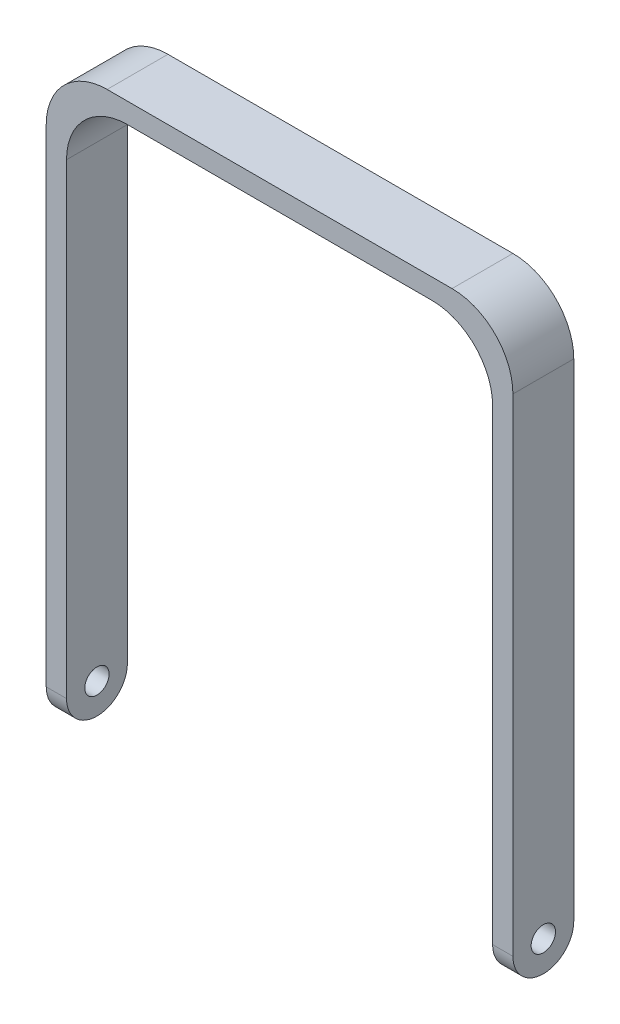
ISO-10303-21;
HEADER;
FILE_DESCRIPTION(('STEP AP214'),'2;1');
FILE_NAME('part.step','',(''),(''),'','','');
FILE_SCHEMA(('AUTOMOTIVE_DESIGN { 1 0 10303 214 1 1 1 1 }'));
ENDSEC;
DATA;
#1=APPLICATION_CONTEXT('core data for automotive mechanical design processes');
#2=APPLICATION_PROTOCOL_DEFINITION('international standard','automotive_design',2000,#1);
#3=PRODUCT_CONTEXT('',#1,'mechanical');
#4=PRODUCT('Part','Part','',(#3));
#5=PRODUCT_RELATED_PRODUCT_CATEGORY('part','',(#4));
#6=PRODUCT_DEFINITION_FORMATION('','',#4);
#7=PRODUCT_DEFINITION_CONTEXT('part definition',#1,'design');
#8=PRODUCT_DEFINITION('design','',#6,#7);
#9=PRODUCT_DEFINITION_SHAPE('','',#8);
#10=(LENGTH_UNIT() NAMED_UNIT(*) SI_UNIT(.MILLI.,.METRE.));
#11=(NAMED_UNIT(*) PLANE_ANGLE_UNIT() SI_UNIT($,.RADIAN.));
#12=(NAMED_UNIT(*) SI_UNIT($,.STERADIAN.) SOLID_ANGLE_UNIT());
#13=UNCERTAINTY_MEASURE_WITH_UNIT(LENGTH_MEASURE(1.E-05),#10,'distance_accuracy_value','');
#14=(GEOMETRIC_REPRESENTATION_CONTEXT(3) GLOBAL_UNCERTAINTY_ASSIGNED_CONTEXT((#13)) GLOBAL_UNIT_ASSIGNED_CONTEXT((#10,
#11,#12)) REPRESENTATION_CONTEXT('',''));
#15=CARTESIAN_POINT('',(0.,0.,0.));
#16=DIRECTION('',(0.,0.,1.));
#17=DIRECTION('',(1.,0.,0.));
#18=AXIS2_PLACEMENT_3D('',#15,#16,#17);
#19=CARTESIAN_POINT('',(36.5125,-46.0375,4.7625));
#20=DIRECTION('',(-1.,0.,0.));
#21=DIRECTION('',(0.,0.,1.));
#22=AXIS2_PLACEMENT_3D('',#19,#20,#21);
#23=PLANE('',#22);
#24=CARTESIAN_POINT('',(36.5125,-39.6875,0.));
#25=DIRECTION('',(-1.,0.,0.));
#26=DIRECTION('',(0.,0.,1.));
#27=AXIS2_PLACEMENT_3D('',#24,#25,#26);
#28=CIRCLE('',#27,1.905);
#29=CARTESIAN_POINT('',(36.5125,-39.6875,1.90500000000001));
#30=VERTEX_POINT('',#29);
#31=EDGE_CURVE('E229',#30,#30,#28,.T.);
#32=ORIENTED_EDGE('',*,*,#31,.T.);
#33=EDGE_LOOP('',(#32));
#34=FACE_BOUND('',#33,.T.);
#35=DIRECTION('',(0.,1.,0.));
#36=VECTOR('',#35,1.);
#37=CARTESIAN_POINT('',(36.5125,-46.0375,-4.7625));
#38=LINE('',#37,#36);
#39=CARTESIAN_POINT('',(36.5125,-39.6875,-4.7625));
#40=VERTEX_POINT('',#39);
#41=CARTESIAN_POINT('',(36.5125,36.5125,-4.7625));
#42=VERTEX_POINT('',#41);
#43=EDGE_CURVE('E136',#40,#42,#38,.T.);
#44=ORIENTED_EDGE('',*,*,#43,.T.);
#45=DIRECTION('',(0.,0.,-1.));
#46=VECTOR('',#45,1.);
#47=CARTESIAN_POINT('',(36.5125,36.5125,4.7625));
#48=LINE('',#47,#46);
#49=CARTESIAN_POINT('',(36.5125,36.5125,4.7625));
#50=VERTEX_POINT('',#49);
#51=EDGE_CURVE('E48',#42,#50,#48,.F.);
#52=ORIENTED_EDGE('',*,*,#51,.T.);
#53=DIRECTION('',(0.,1.,0.));
#54=VECTOR('',#53,1.);
#55=CARTESIAN_POINT('',(36.5125,-46.0375,4.7625));
#56=LINE('',#55,#54);
#57=CARTESIAN_POINT('',(36.5125,-39.6875,4.76250000000002));
#58=VERTEX_POINT('',#57);
#59=EDGE_CURVE('E137',#58,#50,#56,.T.);
#60=ORIENTED_EDGE('',*,*,#59,.F.);
#61=CARTESIAN_POINT('',(36.5125,-39.6875,0.));
#62=DIRECTION('',(1.,0.,0.));
#63=DIRECTION('',(0.,0.,1.));
#64=AXIS2_PLACEMENT_3D('',#61,#62,#63);
#65=CIRCLE('',#64,4.76250000000001);
#66=EDGE_CURVE('E127',#58,#40,#65,.T.);
#67=ORIENTED_EDGE('',*,*,#66,.T.);
#68=EDGE_LOOP('',(#44,#52,#60,#67));
#69=FACE_BOUND('',#68,.T.);
#70=ADVANCED_FACE('F33',(#34,#69),#23,.F.);
#71=CARTESIAN_POINT('',(-36.5125,46.0375,4.7625));
#72=DIRECTION('',(0.,-1.,0.));
#73=DIRECTION('',(0.,0.,-1.));
#74=AXIS2_PLACEMENT_3D('',#71,#72,#73);
#75=PLANE('',#74);
#76=DIRECTION('',(-1.,0.,0.));
#77=VECTOR('',#76,1.);
#78=CARTESIAN_POINT('',(-36.5125,46.0375,-4.7625));
#79=LINE('',#78,#77);
#80=CARTESIAN_POINT('',(26.9875,46.0375,-4.7625));
#81=VERTEX_POINT('',#80);
#82=CARTESIAN_POINT('',(-26.9875,46.0375,-4.7625));
#83=VERTEX_POINT('',#82);
#84=EDGE_CURVE('E143',#81,#83,#79,.T.);
#85=ORIENTED_EDGE('',*,*,#84,.T.);
#86=DIRECTION('',(0.,0.,-1.));
#87=VECTOR('',#86,1.);
#88=CARTESIAN_POINT('',(-26.9875,46.0375,4.7625));
#89=LINE('',#88,#87);
#90=CARTESIAN_POINT('',(-26.9875,46.0375,4.7625));
#91=VERTEX_POINT('',#90);
#92=EDGE_CURVE('E190',#83,#91,#89,.F.);
#93=ORIENTED_EDGE('',*,*,#92,.T.);
#94=DIRECTION('',(-1.,0.,0.));
#95=VECTOR('',#94,1.);
#96=CARTESIAN_POINT('',(-36.5125,46.0375,4.7625));
#97=LINE('',#96,#95);
#98=CARTESIAN_POINT('',(26.9875,46.0375,4.7625));
#99=VERTEX_POINT('',#98);
#100=EDGE_CURVE('E220',#99,#91,#97,.T.);
#101=ORIENTED_EDGE('',*,*,#100,.F.);
#102=DIRECTION('',(0.,0.,-1.));
#103=VECTOR('',#102,1.);
#104=CARTESIAN_POINT('',(26.9875,46.0375,4.7625));
#105=LINE('',#104,#103);
#106=EDGE_CURVE('E187',#99,#81,#105,.T.);
#107=ORIENTED_EDGE('',*,*,#106,.T.);
#108=EDGE_LOOP('',(#85,#93,#101,#107));
#109=FACE_BOUND('',#108,.T.);
#110=ADVANCED_FACE('F245',(#109),#75,.F.);
#111=CARTESIAN_POINT('',(-36.5125,-46.0375,4.7625));
#112=DIRECTION('',(1.,0.,0.));
#113=DIRECTION('',(0.,0.,-1.));
#114=AXIS2_PLACEMENT_3D('',#111,#112,#113);
#115=PLANE('',#114);
#116=CARTESIAN_POINT('',(-36.5125,-39.6875,0.));
#117=DIRECTION('',(1.,0.,0.));
#118=DIRECTION('',(0.,0.,-1.));
#119=AXIS2_PLACEMENT_3D('',#116,#117,#118);
#120=CIRCLE('',#119,1.905);
#121=CARTESIAN_POINT('',(-36.5125,-39.6875,-1.90499999999999));
#122=VERTEX_POINT('',#121);
#123=EDGE_CURVE('E144',#122,#122,#120,.T.);
#124=ORIENTED_EDGE('',*,*,#123,.T.);
#125=EDGE_LOOP('',(#124));
#126=FACE_BOUND('',#125,.T.);
#127=DIRECTION('',(0.,-1.,0.));
#128=VECTOR('',#127,1.);
#129=CARTESIAN_POINT('',(-36.5125,-46.0375,4.7625));
#130=LINE('',#129,#128);
#131=CARTESIAN_POINT('',(-36.5125,36.5125,4.7625));
#132=VERTEX_POINT('',#131);
#133=CARTESIAN_POINT('',(-36.5125,-39.6875,4.76250000000001));
#134=VERTEX_POINT('',#133);
#135=EDGE_CURVE('E216',#132,#134,#130,.T.);
#136=ORIENTED_EDGE('',*,*,#135,.F.);
#137=DIRECTION('',(0.,0.,-1.));
#138=VECTOR('',#137,1.);
#139=CARTESIAN_POINT('',(-36.5125,36.5125,4.7625));
#140=LINE('',#139,#138);
#141=CARTESIAN_POINT('',(-36.5125,36.5125,-4.7625));
#142=VERTEX_POINT('',#141);
#143=EDGE_CURVE('E181',#132,#142,#140,.T.);
#144=ORIENTED_EDGE('',*,*,#143,.T.);
#145=DIRECTION('',(0.,-1.,0.));
#146=VECTOR('',#145,1.);
#147=CARTESIAN_POINT('',(-36.5125,-46.0375,-4.7625));
#148=LINE('',#147,#146);
#149=CARTESIAN_POINT('',(-36.5125,-39.6875,-4.7625));
#150=VERTEX_POINT('',#149);
#151=EDGE_CURVE('E147',#142,#150,#148,.T.);
#152=ORIENTED_EDGE('',*,*,#151,.T.);
#153=CARTESIAN_POINT('',(-36.5125,-39.6875,0.));
#154=DIRECTION('',(-1.,0.,0.));
#155=DIRECTION('',(0.,0.,1.));
#156=AXIS2_PLACEMENT_3D('',#153,#154,#155);
#157=CIRCLE('',#156,4.76250000000001);
#158=EDGE_CURVE('E171',#134,#150,#157,.F.);
#159=ORIENTED_EDGE('',*,*,#158,.F.);
#160=EDGE_LOOP('',(#136,#144,#152,#159));
#161=FACE_BOUND('',#160,.T.);
#162=ADVANCED_FACE('F254',(#126,#161),#115,.F.);
#163=CARTESIAN_POINT('',(-33.3375,-46.0375,4.7625));
#164=DIRECTION('',(-1.,0.,0.));
#165=DIRECTION('',(0.,0.,1.));
#166=AXIS2_PLACEMENT_3D('',#163,#164,#165);
#167=PLANE('',#166);
#168=CARTESIAN_POINT('',(-33.3375,-39.6875,0.));
#169=DIRECTION('',(-1.,0.,0.));
#170=DIRECTION('',(0.,0.,1.));
#171=AXIS2_PLACEMENT_3D('',#168,#169,#170);
#172=CIRCLE('',#171,1.905);
#173=CARTESIAN_POINT('',(-33.3375,-39.6875,1.90500000000001));
#174=VERTEX_POINT('',#173);
#175=EDGE_CURVE('E150',#174,#174,#172,.T.);
#176=ORIENTED_EDGE('',*,*,#175,.T.);
#177=EDGE_LOOP('',(#176));
#178=FACE_BOUND('',#177,.T.);
#179=DIRECTION('',(0.,1.,0.));
#180=VECTOR('',#179,1.);
#181=CARTESIAN_POINT('',(-33.3375,-46.0375,-4.7625));
#182=LINE('',#181,#180);
#183=CARTESIAN_POINT('',(-33.3375,-39.6875,-4.7625));
#184=VERTEX_POINT('',#183);
#185=CARTESIAN_POINT('',(-33.3375,33.3375,-4.7625));
#186=VERTEX_POINT('',#185);
#187=EDGE_CURVE('E157',#184,#186,#182,.T.);
#188=ORIENTED_EDGE('',*,*,#187,.T.);
#189=DIRECTION('',(0.,0.,-1.));
#190=VECTOR('',#189,1.);
#191=CARTESIAN_POINT('',(-33.3375,33.3375,4.7625));
#192=LINE('',#191,#190);
#193=CARTESIAN_POINT('',(-33.3375,33.3375,4.7625));
#194=VERTEX_POINT('',#193);
#195=EDGE_CURVE('E179',#186,#194,#192,.F.);
#196=ORIENTED_EDGE('',*,*,#195,.T.);
#197=DIRECTION('',(0.,1.,0.));
#198=VECTOR('',#197,1.);
#199=CARTESIAN_POINT('',(-33.3375,-46.0375,4.7625));
#200=LINE('',#199,#198);
#201=CARTESIAN_POINT('',(-33.3375,-39.6875,4.76250000000002));
#202=VERTEX_POINT('',#201);
#203=EDGE_CURVE('E214',#202,#194,#200,.T.);
#204=ORIENTED_EDGE('',*,*,#203,.F.);
#205=CARTESIAN_POINT('',(-33.3375,-39.6875,0.));
#206=DIRECTION('',(-1.,0.,0.));
#207=DIRECTION('',(0.,0.,1.));
#208=AXIS2_PLACEMENT_3D('',#205,#206,#207);
#209=CIRCLE('',#208,4.76250000000001);
#210=EDGE_CURVE('E174',#202,#184,#209,.F.);
#211=ORIENTED_EDGE('',*,*,#210,.T.);
#212=EDGE_LOOP('',(#188,#196,#204,#211));
#213=FACE_BOUND('',#212,.T.);
#214=ADVANCED_FACE('F262',(#178,#213),#167,.F.);
#215=CARTESIAN_POINT('',(33.3375,42.8625,4.7625));
#216=DIRECTION('',(0.,1.,0.));
#217=DIRECTION('',(0.,0.,1.));
#218=AXIS2_PLACEMENT_3D('',#215,#216,#217);
#219=PLANE('',#218);
#220=DIRECTION('',(1.,0.,0.));
#221=VECTOR('',#220,1.);
#222=CARTESIAN_POINT('',(33.3375,42.8625,4.7625));
#223=LINE('',#222,#221);
#224=CARTESIAN_POINT('',(-23.8125,42.8625,4.7625));
#225=VERTEX_POINT('',#224);
#226=CARTESIAN_POINT('',(23.8125,42.8625,4.7625));
#227=VERTEX_POINT('',#226);
#228=EDGE_CURVE('E213',#225,#227,#223,.T.);
#229=ORIENTED_EDGE('',*,*,#228,.F.);
#230=DIRECTION('',(0.,0.,-1.));
#231=VECTOR('',#230,1.);
#232=CARTESIAN_POINT('',(-23.8125,42.8625,-4.7625));
#233=LINE('',#232,#231);
#234=CARTESIAN_POINT('',(-23.8125,42.8625,-4.7625));
#235=VERTEX_POINT('',#234);
#236=EDGE_CURVE('E176',#225,#235,#233,.T.);
#237=ORIENTED_EDGE('',*,*,#236,.T.);
#238=DIRECTION('',(1.,0.,0.));
#239=VECTOR('',#238,1.);
#240=CARTESIAN_POINT('',(33.3375,42.8625,-4.7625));
#241=LINE('',#240,#239);
#242=CARTESIAN_POINT('',(23.8125,42.8625,-4.7625));
#243=VERTEX_POINT('',#242);
#244=EDGE_CURVE('E160',#235,#243,#241,.T.);
#245=ORIENTED_EDGE('',*,*,#244,.T.);
#246=DIRECTION('',(0.,0.,-1.));
#247=VECTOR('',#246,1.);
#248=CARTESIAN_POINT('',(23.8125,42.8625,4.7625));
#249=LINE('',#248,#247);
#250=EDGE_CURVE('E167',#243,#227,#249,.F.);
#251=ORIENTED_EDGE('',*,*,#250,.T.);
#252=EDGE_LOOP('',(#229,#237,#245,#251));
#253=FACE_BOUND('',#252,.T.);
#254=ADVANCED_FACE('F209',(#253),#219,.F.);
#255=CARTESIAN_POINT('',(33.3375,-46.0375,4.7625));
#256=DIRECTION('',(1.,0.,0.));
#257=DIRECTION('',(0.,0.,-1.));
#258=AXIS2_PLACEMENT_3D('',#255,#256,#257);
#259=PLANE('',#258);
#260=CARTESIAN_POINT('',(33.3375,-39.6875,0.));
#261=DIRECTION('',(1.,0.,0.));
#262=DIRECTION('',(0.,0.,-1.));
#263=AXIS2_PLACEMENT_3D('',#260,#261,#262);
#264=CIRCLE('',#263,1.905);
#265=CARTESIAN_POINT('',(33.3375,-39.6875,-1.90499999999999));
#266=VERTEX_POINT('',#265);
#267=EDGE_CURVE('E168',#266,#266,#264,.T.);
#268=ORIENTED_EDGE('',*,*,#267,.T.);
#269=EDGE_LOOP('',(#268));
#270=FACE_BOUND('',#269,.T.);
#271=DIRECTION('',(0.,-1.,0.));
#272=VECTOR('',#271,1.);
#273=CARTESIAN_POINT('',(33.3375,-46.0375,4.7625));
#274=LINE('',#273,#272);
#275=CARTESIAN_POINT('',(33.3375,33.3375,4.7625));
#276=VERTEX_POINT('',#275);
#277=CARTESIAN_POINT('',(33.3375,-39.6875,4.76250000000002));
#278=VERTEX_POINT('',#277);
#279=EDGE_CURVE('E153',#276,#278,#274,.T.);
#280=ORIENTED_EDGE('',*,*,#279,.F.);
#281=DIRECTION('',(0.,0.,-1.));
#282=VECTOR('',#281,1.);
#283=CARTESIAN_POINT('',(33.3375,33.3375,-4.7625));
#284=LINE('',#283,#282);
#285=CARTESIAN_POINT('',(33.3375,33.3375,-4.7625));
#286=VERTEX_POINT('',#285);
#287=EDGE_CURVE('E197',#276,#286,#284,.T.);
#288=ORIENTED_EDGE('',*,*,#287,.T.);
#289=DIRECTION('',(0.,-1.,0.));
#290=VECTOR('',#289,1.);
#291=CARTESIAN_POINT('',(33.3375,-46.0375,-4.7625));
#292=LINE('',#291,#290);
#293=CARTESIAN_POINT('',(33.3375,-39.6875,-4.7625));
#294=VERTEX_POINT('',#293);
#295=EDGE_CURVE('E163',#286,#294,#292,.T.);
#296=ORIENTED_EDGE('',*,*,#295,.T.);
#297=CARTESIAN_POINT('',(33.3375,-39.6875,0.));
#298=DIRECTION('',(1.,0.,0.));
#299=DIRECTION('',(0.,0.,-1.));
#300=AXIS2_PLACEMENT_3D('',#297,#298,#299);
#301=CIRCLE('',#300,4.76250000000001);
#302=EDGE_CURVE('E130',#294,#278,#301,.F.);
#303=ORIENTED_EDGE('',*,*,#302,.T.);
#304=EDGE_LOOP('',(#280,#288,#296,#303));
#305=FACE_BOUND('',#304,.T.);
#306=ADVANCED_FACE('F212',(#270,#305),#259,.F.);
#307=CARTESIAN_POINT('',(0.,0.,4.7625));
#308=DIRECTION('',(0.,0.,-1.));
#309=DIRECTION('',(-1.,0.,0.));
#310=AXIS2_PLACEMENT_3D('',#307,#308,#309);
#311=PLANE('',#310);
#312=ORIENTED_EDGE('',*,*,#100,.T.);
#313=CARTESIAN_POINT('',(-26.9875,36.5125,4.7625));
#314=DIRECTION('',(0.,0.,-1.));
#315=DIRECTION('',(-1.,0.,0.));
#316=AXIS2_PLACEMENT_3D('',#313,#314,#315);
#317=CIRCLE('',#316,9.525);
#318=EDGE_CURVE('E194',#91,#132,#317,.F.);
#319=ORIENTED_EDGE('',*,*,#318,.T.);
#320=ORIENTED_EDGE('',*,*,#135,.T.);
#321=DIRECTION('',(-1.,0.,0.));
#322=VECTOR('',#321,1.);
#323=CARTESIAN_POINT('',(36.5125,-39.6875,4.76250000000002));
#324=LINE('',#323,#322);
#325=EDGE_CURVE('E134',#202,#134,#324,.T.);
#326=ORIENTED_EDGE('',*,*,#325,.F.);
#327=ORIENTED_EDGE('',*,*,#203,.T.);
#328=CARTESIAN_POINT('',(-23.8125,33.3375,4.7625));
#329=DIRECTION('',(0.,0.,-1.));
#330=DIRECTION('',(-1.,0.,0.));
#331=AXIS2_PLACEMENT_3D('',#328,#329,#330);
#332=CIRCLE('',#331,9.525);
#333=EDGE_CURVE('E202',#194,#225,#332,.T.);
#334=ORIENTED_EDGE('',*,*,#333,.T.);
#335=ORIENTED_EDGE('',*,*,#228,.T.);
#336=CARTESIAN_POINT('',(23.8125,33.3375,4.7625));
#337=DIRECTION('',(0.,0.,-1.));
#338=DIRECTION('',(-1.,0.,0.));
#339=AXIS2_PLACEMENT_3D('',#336,#337,#338);
#340=CIRCLE('',#339,9.525);
#341=EDGE_CURVE('E11',#227,#276,#340,.T.);
#342=ORIENTED_EDGE('',*,*,#341,.T.);
#343=ORIENTED_EDGE('',*,*,#279,.T.);
#344=EDGE_CURVE('E232',#58,#278,#324,.T.);
#345=ORIENTED_EDGE('',*,*,#344,.F.);
#346=ORIENTED_EDGE('',*,*,#59,.T.);
#347=CARTESIAN_POINT('',(26.9875,36.5125,4.7625));
#348=DIRECTION('',(0.,0.,-1.));
#349=DIRECTION('',(-1.,0.,0.));
#350=AXIS2_PLACEMENT_3D('',#347,#348,#349);
#351=CIRCLE('',#350,9.525);
#352=EDGE_CURVE('E192',#50,#99,#351,.F.);
#353=ORIENTED_EDGE('',*,*,#352,.T.);
#354=EDGE_LOOP('',(#312,#319,#320,#326,#327,#334,#335,#342,#343,#345,#346,#353));
#355=FACE_BOUND('',#354,.T.);
#356=ADVANCED_FACE('F238',(#355),#311,.F.);
#357=CARTESIAN_POINT('',(0.,0.,-4.7625));
#358=DIRECTION('',(0.,0.,-1.));
#359=DIRECTION('',(-1.,0.,0.));
#360=AXIS2_PLACEMENT_3D('',#357,#358,#359);
#361=PLANE('',#360);
#362=ORIENTED_EDGE('',*,*,#151,.F.);
#363=CARTESIAN_POINT('',(-26.9875,36.5125,-4.7625));
#364=DIRECTION('',(0.,0.,-1.));
#365=DIRECTION('',(-1.,0.,0.));
#366=AXIS2_PLACEMENT_3D('',#363,#364,#365);
#367=CIRCLE('',#366,9.525);
#368=EDGE_CURVE('E185',#142,#83,#367,.T.);
#369=ORIENTED_EDGE('',*,*,#368,.T.);
#370=ORIENTED_EDGE('',*,*,#84,.F.);
#371=CARTESIAN_POINT('',(26.9875,36.5125,-4.7625));
#372=DIRECTION('',(0.,0.,-1.));
#373=DIRECTION('',(-1.,0.,0.));
#374=AXIS2_PLACEMENT_3D('',#371,#372,#373);
#375=CIRCLE('',#374,9.525);
#376=EDGE_CURVE('E142',#81,#42,#375,.T.);
#377=ORIENTED_EDGE('',*,*,#376,.T.);
#378=ORIENTED_EDGE('',*,*,#43,.F.);
#379=DIRECTION('',(-1.,0.,0.));
#380=VECTOR('',#379,1.);
#381=CARTESIAN_POINT('',(36.5125,-39.6875,-4.7625));
#382=LINE('',#381,#380);
#383=EDGE_CURVE('E123',#40,#294,#382,.T.);
#384=ORIENTED_EDGE('',*,*,#383,.T.);
#385=ORIENTED_EDGE('',*,*,#295,.F.);
#386=CARTESIAN_POINT('',(23.8125,33.3375,-4.7625));
#387=DIRECTION('',(0.,0.,-1.));
#388=DIRECTION('',(-1.,0.,0.));
#389=AXIS2_PLACEMENT_3D('',#386,#387,#388);
#390=CIRCLE('',#389,9.525);
#391=EDGE_CURVE('E41',#286,#243,#390,.F.);
#392=ORIENTED_EDGE('',*,*,#391,.T.);
#393=ORIENTED_EDGE('',*,*,#244,.F.);
#394=CARTESIAN_POINT('',(-23.8125,33.3375,-4.7625));
#395=DIRECTION('',(0.,0.,-1.));
#396=DIRECTION('',(-1.,0.,0.));
#397=AXIS2_PLACEMENT_3D('',#394,#395,#396);
#398=CIRCLE('',#397,9.525);
#399=EDGE_CURVE('E200',#235,#186,#398,.F.);
#400=ORIENTED_EDGE('',*,*,#399,.T.);
#401=ORIENTED_EDGE('',*,*,#187,.F.);
#402=DIRECTION('',(-1.,0.,0.));
#403=VECTOR('',#402,1.);
#404=CARTESIAN_POINT('',(36.5125,-39.6875,-4.7625));
#405=LINE('',#404,#403);
#406=EDGE_CURVE('E165',#150,#184,#405,.F.);
#407=ORIENTED_EDGE('',*,*,#406,.F.);
#408=EDGE_LOOP('',(#362,#369,#370,#377,#378,#384,#385,#392,#393,#400,#401,#407));
#409=FACE_BOUND('',#408,.T.);
#410=ADVANCED_FACE('F140',(#409),#361,.T.);
#411=CARTESIAN_POINT('',(36.5125,-39.6875,0.));
#412=DIRECTION('',(-1.,0.,0.));
#413=DIRECTION('',(0.,0.,1.));
#414=AXIS2_PLACEMENT_3D('',#411,#412,#413);
#415=CYLINDRICAL_SURFACE('',#414,4.76250000000001);
#416=ORIENTED_EDGE('',*,*,#383,.F.);
#417=ORIENTED_EDGE('',*,*,#66,.F.);
#418=ORIENTED_EDGE('',*,*,#344,.T.);
#419=ORIENTED_EDGE('',*,*,#302,.F.);
#420=EDGE_LOOP('',(#416,#417,#418,#419));
#421=FACE_BOUND('',#420,.T.);
#422=ADVANCED_FACE('F125',(#421),#415,.T.);
#423=ORIENTED_EDGE('',*,*,#406,.T.);
#424=ORIENTED_EDGE('',*,*,#210,.F.);
#425=ORIENTED_EDGE('',*,*,#325,.T.);
#426=ORIENTED_EDGE('',*,*,#158,.T.);
#427=EDGE_LOOP('',(#423,#424,#425,#426));
#428=FACE_BOUND('',#427,.T.);
#429=ADVANCED_FACE('F259',(#428),#415,.T.);
#430=CARTESIAN_POINT('',(36.5125,-39.6875,0.));
#431=DIRECTION('',(-1.,0.,0.));
#432=DIRECTION('',(0.,0.,1.));
#433=AXIS2_PLACEMENT_3D('',#430,#431,#432);
#434=CYLINDRICAL_SURFACE('',#433,1.905);
#435=ORIENTED_EDGE('',*,*,#31,.F.);
#436=EDGE_LOOP('',(#435));
#437=FACE_BOUND('',#436,.T.);
#438=ORIENTED_EDGE('',*,*,#267,.F.);
#439=EDGE_LOOP('',(#438));
#440=FACE_BOUND('',#439,.T.);
#441=ADVANCED_FACE('F275',(#437,#440),#434,.F.);
#442=ORIENTED_EDGE('',*,*,#175,.F.);
#443=EDGE_LOOP('',(#442));
#444=FACE_BOUND('',#443,.T.);
#445=ORIENTED_EDGE('',*,*,#123,.F.);
#446=EDGE_LOOP('',(#445));
#447=FACE_BOUND('',#446,.T.);
#448=ADVANCED_FACE('F268',(#444,#447),#434,.F.);
#449=CARTESIAN_POINT('',(-23.8125,33.3375,4.7625));
#450=DIRECTION('',(0.,0.,1.));
#451=DIRECTION('',(1.,0.,0.));
#452=AXIS2_PLACEMENT_3D('',#449,#450,#451);
#453=CYLINDRICAL_SURFACE('',#452,9.525);
#454=ORIENTED_EDGE('',*,*,#333,.F.);
#455=ORIENTED_EDGE('',*,*,#195,.F.);
#456=ORIENTED_EDGE('',*,*,#399,.F.);
#457=ORIENTED_EDGE('',*,*,#236,.F.);
#458=EDGE_LOOP('',(#454,#455,#456,#457));
#459=FACE_BOUND('',#458,.T.);
#460=ADVANCED_FACE('F266',(#459),#453,.F.);
#461=CARTESIAN_POINT('',(-26.9875,36.5125,4.7625));
#462=DIRECTION('',(0.,0.,-1.));
#463=DIRECTION('',(-1.,0.,0.));
#464=AXIS2_PLACEMENT_3D('',#461,#462,#463);
#465=CYLINDRICAL_SURFACE('',#464,9.525);
#466=ORIENTED_EDGE('',*,*,#318,.F.);
#467=ORIENTED_EDGE('',*,*,#92,.F.);
#468=ORIENTED_EDGE('',*,*,#368,.F.);
#469=ORIENTED_EDGE('',*,*,#143,.F.);
#470=EDGE_LOOP('',(#466,#467,#468,#469));
#471=FACE_BOUND('',#470,.T.);
#472=ADVANCED_FACE('F251',(#471),#465,.T.);
#473=CARTESIAN_POINT('',(26.9875,36.5125,4.7625));
#474=DIRECTION('',(0.,0.,-1.));
#475=DIRECTION('',(-1.,0.,0.));
#476=AXIS2_PLACEMENT_3D('',#473,#474,#475);
#477=CYLINDRICAL_SURFACE('',#476,9.525);
#478=ORIENTED_EDGE('',*,*,#352,.F.);
#479=ORIENTED_EDGE('',*,*,#51,.F.);
#480=ORIENTED_EDGE('',*,*,#376,.F.);
#481=ORIENTED_EDGE('',*,*,#106,.F.);
#482=EDGE_LOOP('',(#478,#479,#480,#481));
#483=FACE_BOUND('',#482,.T.);
#484=ADVANCED_FACE('F243',(#483),#477,.T.);
#485=CARTESIAN_POINT('',(23.8125,33.3375,4.7625));
#486=DIRECTION('',(0.,0.,1.));
#487=DIRECTION('',(1.,0.,0.));
#488=AXIS2_PLACEMENT_3D('',#485,#486,#487);
#489=CYLINDRICAL_SURFACE('',#488,9.525);
#490=ORIENTED_EDGE('',*,*,#341,.F.);
#491=ORIENTED_EDGE('',*,*,#250,.F.);
#492=ORIENTED_EDGE('',*,*,#391,.F.);
#493=ORIENTED_EDGE('',*,*,#287,.F.);
#494=EDGE_LOOP('',(#490,#491,#492,#493));
#495=FACE_BOUND('',#494,.T.);
#496=ADVANCED_FACE('F35',(#495),#489,.F.);
#497=CLOSED_SHELL('',(#70,#110,#162,#214,#254,#306,#356,#410,#422,#429,#441,#448,#460,#472,#484,#496));
#498=MANIFOLD_SOLID_BREP('B2',#497);
#499=ADVANCED_BREP_SHAPE_REPRESENTATION('',(#18,#498),#14);
#500=SHAPE_DEFINITION_REPRESENTATION(#9,#499);
ENDSEC;
END-ISO-10303-21;
